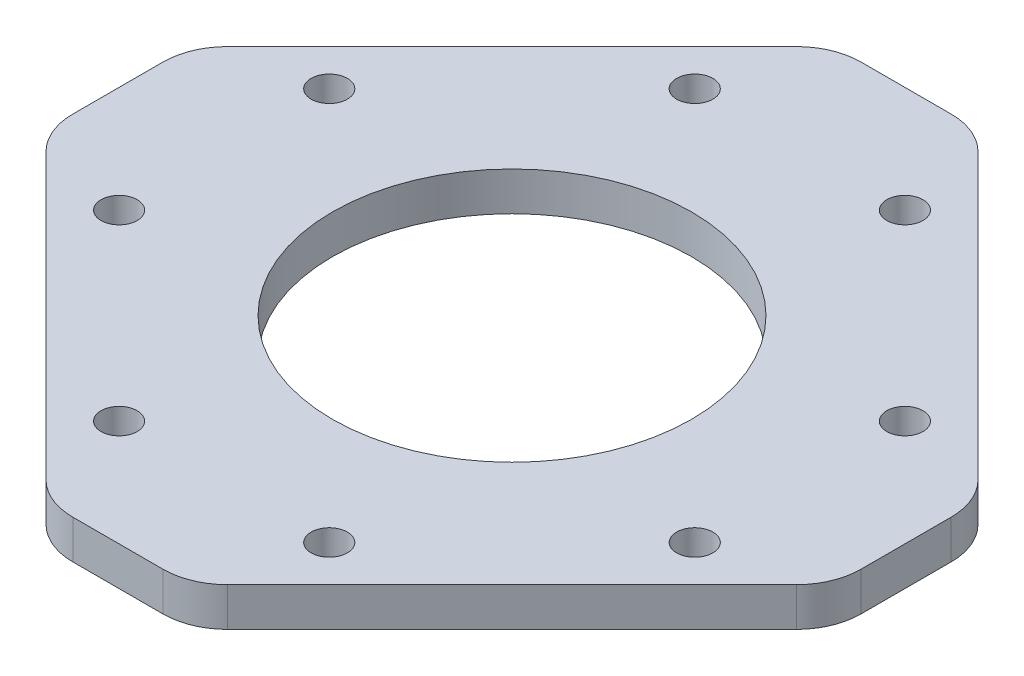
ISO-10303-21;
HEADER;
FILE_DESCRIPTION(('STEP AP214'),'2;1');
FILE_NAME('part.step','',(''),(''),'','','');
FILE_SCHEMA(('AUTOMOTIVE_DESIGN { 1 0 10303 214 1 1 1 1 }'));
ENDSEC;
DATA;
#1=APPLICATION_CONTEXT('core data for automotive mechanical design processes');
#2=APPLICATION_PROTOCOL_DEFINITION('international standard','automotive_design',2000,#1);
#3=PRODUCT_CONTEXT('',#1,'mechanical');
#4=PRODUCT('Part','Part','',(#3));
#5=PRODUCT_RELATED_PRODUCT_CATEGORY('part','',(#4));
#6=PRODUCT_DEFINITION_FORMATION('','',#4);
#7=PRODUCT_DEFINITION_CONTEXT('part definition',#1,'design');
#8=PRODUCT_DEFINITION('design','',#6,#7);
#9=PRODUCT_DEFINITION_SHAPE('','',#8);
#10=(LENGTH_UNIT() NAMED_UNIT(*) SI_UNIT(.MILLI.,.METRE.));
#11=(NAMED_UNIT(*) PLANE_ANGLE_UNIT() SI_UNIT($,.RADIAN.));
#12=(NAMED_UNIT(*) SI_UNIT($,.STERADIAN.) SOLID_ANGLE_UNIT());
#13=UNCERTAINTY_MEASURE_WITH_UNIT(LENGTH_MEASURE(1.E-05),#10,'distance_accuracy_value','');
#14=(GEOMETRIC_REPRESENTATION_CONTEXT(3) GLOBAL_UNCERTAINTY_ASSIGNED_CONTEXT((#13)) GLOBAL_UNIT_ASSIGNED_CONTEXT((#10,
#11,#12)) REPRESENTATION_CONTEXT('',''));
#15=CARTESIAN_POINT('',(0.,0.,0.));
#16=DIRECTION('',(0.,0.,1.));
#17=DIRECTION('',(1.,0.,0.));
#18=AXIS2_PLACEMENT_3D('',#15,#16,#17);
#19=CARTESIAN_POINT('',(3.49137802864851,3.,-25.5));
#20=DIRECTION('',(0.,1.,0.));
#21=DIRECTION('',(0.,0.,1.));
#22=AXIS2_PLACEMENT_3D('',#19,#20,#21);
#23=PLANE('',#22);
#24=CARTESIAN_POINT('',(-8.1317279836453,3.,-22.2738636073762));
#25=DIRECTION('',(0.,1.,0.));
#26=DIRECTION('',(0.,0.,1.));
#27=AXIS2_PLACEMENT_3D('',#24,#25,#26);
#28=CIRCLE('',#27,1.4);
#29=CARTESIAN_POINT('',(-8.1317279836453,3.,-20.8738636073762));
#30=VERTEX_POINT('',#29);
#31=EDGE_CURVE('E296',#30,#30,#28,.T.);
#32=ORIENTED_EDGE('',*,*,#31,.F.);
#33=EDGE_LOOP('',(#32));
#34=FACE_BOUND('',#33,.T.);
#35=CARTESIAN_POINT('',(22.2738636073762,3.,-8.1317279836453));
#36=DIRECTION('',(0.,1.,0.));
#37=DIRECTION('',(0.,0.,1.));
#38=AXIS2_PLACEMENT_3D('',#35,#36,#37);
#39=CIRCLE('',#38,1.4);
#40=CARTESIAN_POINT('',(22.2738636073762,3.,-6.7317279836453));
#41=VERTEX_POINT('',#40);
#42=EDGE_CURVE('E290',#41,#41,#39,.T.);
#43=ORIENTED_EDGE('',*,*,#42,.F.);
#44=EDGE_LOOP('',(#43));
#45=FACE_BOUND('',#44,.T.);
#46=CARTESIAN_POINT('',(-22.2738636073762,3.,8.1317279836453));
#47=DIRECTION('',(0.,1.,0.));
#48=DIRECTION('',(0.,0.,1.));
#49=AXIS2_PLACEMENT_3D('',#46,#47,#48);
#50=CIRCLE('',#49,1.4);
#51=CARTESIAN_POINT('',(-22.2738636073762,3.,9.5317279836453));
#52=VERTEX_POINT('',#51);
#53=EDGE_CURVE('E284',#52,#52,#50,.T.);
#54=ORIENTED_EDGE('',*,*,#53,.F.);
#55=EDGE_LOOP('',(#54));
#56=FACE_BOUND('',#55,.T.);
#57=CARTESIAN_POINT('',(8.13172798364529,3.,22.2738636073762));
#58=DIRECTION('',(0.,1.,0.));
#59=DIRECTION('',(0.,0.,1.));
#60=AXIS2_PLACEMENT_3D('',#57,#58,#59);
#61=CIRCLE('',#60,1.4);
#62=CARTESIAN_POINT('',(8.13172798364529,3.,23.6738636073762));
#63=VERTEX_POINT('',#62);
#64=EDGE_CURVE('E218',#63,#63,#61,.T.);
#65=ORIENTED_EDGE('',*,*,#64,.F.);
#66=EDGE_LOOP('',(#65));
#67=FACE_BOUND('',#66,.T.);
#68=CARTESIAN_POINT('',(3.49137802864851,3.,-25.5));
#69=DIRECTION('',(0.,1.,0.));
#70=DIRECTION('',(0.,0.,1.));
#71=AXIS2_PLACEMENT_3D('',#68,#69,#70);
#72=CIRCLE('',#71,4.99999999999999);
#73=CARTESIAN_POINT('',(7.02691193458125,3.,-29.0355339059327));
#74=VERTEX_POINT('',#73);
#75=CARTESIAN_POINT('',(3.49137802864851,3.,-30.5));
#76=VERTEX_POINT('',#75);
#77=EDGE_CURVE('E219',#74,#76,#72,.T.);
#78=ORIENTED_EDGE('',*,*,#77,.T.);
#79=DIRECTION('',(-1.,0.,0.));
#80=VECTOR('',#79,1.);
#81=CARTESIAN_POINT('',(3.49137802864851,3.,-30.5));
#82=LINE('',#81,#80);
#83=CARTESIAN_POINT('',(-3.4913780286485,3.,-30.5));
#84=VERTEX_POINT('',#83);
#85=EDGE_CURVE('E130',#76,#84,#82,.T.);
#86=ORIENTED_EDGE('',*,*,#85,.T.);
#87=CARTESIAN_POINT('',(-3.4913780286485,3.,-25.5));
#88=DIRECTION('',(0.,1.,0.));
#89=DIRECTION('',(0.,0.,1.));
#90=AXIS2_PLACEMENT_3D('',#87,#88,#89);
#91=CIRCLE('',#90,4.99999999999999);
#92=CARTESIAN_POINT('',(-7.02691193458124,3.,-29.0355339059327));
#93=VERTEX_POINT('',#92);
#94=EDGE_CURVE('E233',#84,#93,#91,.T.);
#95=ORIENTED_EDGE('',*,*,#94,.T.);
#96=DIRECTION('',(-0.707106781186547,0.,0.707106781186548));
#97=VECTOR('',#96,1.);
#98=CARTESIAN_POINT('',(-7.02691193458124,3.,-29.0355339059327));
#99=LINE('',#98,#97);
#100=CARTESIAN_POINT('',(-29.0355339059327,3.,-7.02691193458124));
#101=VERTEX_POINT('',#100);
#102=EDGE_CURVE('E236',#93,#101,#99,.T.);
#103=ORIENTED_EDGE('',*,*,#102,.T.);
#104=CARTESIAN_POINT('',(-25.5,3.,-3.4913780286485));
#105=DIRECTION('',(0.,1.,0.));
#106=DIRECTION('',(0.,0.,1.));
#107=AXIS2_PLACEMENT_3D('',#104,#105,#106);
#108=CIRCLE('',#107,4.99999999999999);
#109=CARTESIAN_POINT('',(-30.5,3.,-3.4913780286485));
#110=VERTEX_POINT('',#109);
#111=EDGE_CURVE('E240',#101,#110,#108,.T.);
#112=ORIENTED_EDGE('',*,*,#111,.T.);
#113=DIRECTION('',(0.,0.,1.));
#114=VECTOR('',#113,1.);
#115=CARTESIAN_POINT('',(-30.5,3.,-3.4913780286485));
#116=LINE('',#115,#114);
#117=CARTESIAN_POINT('',(-30.5,3.,3.4913780286485));
#118=VERTEX_POINT('',#117);
#119=EDGE_CURVE('E244',#110,#118,#116,.T.);
#120=ORIENTED_EDGE('',*,*,#119,.T.);
#121=CARTESIAN_POINT('',(-25.5,3.,3.4913780286485));
#122=DIRECTION('',(0.,1.,0.));
#123=DIRECTION('',(0.,0.,1.));
#124=AXIS2_PLACEMENT_3D('',#121,#122,#123);
#125=CIRCLE('',#124,4.99999999999999);
#126=CARTESIAN_POINT('',(-29.0355339059327,3.,7.02691193458123));
#127=VERTEX_POINT('',#126);
#128=EDGE_CURVE('E252',#118,#127,#125,.T.);
#129=ORIENTED_EDGE('',*,*,#128,.T.);
#130=DIRECTION('',(0.707106781186547,0.,0.707106781186548));
#131=VECTOR('',#130,1.);
#132=CARTESIAN_POINT('',(-29.0355339059327,3.,7.02691193458123));
#133=LINE('',#132,#131);
#134=CARTESIAN_POINT('',(-7.02691193458126,3.,29.0355339059327));
#135=VERTEX_POINT('',#134);
#136=EDGE_CURVE('E255',#127,#135,#133,.T.);
#137=ORIENTED_EDGE('',*,*,#136,.T.);
#138=CARTESIAN_POINT('',(-3.49137802864851,3.,25.5));
#139=DIRECTION('',(0.,1.,0.));
#140=DIRECTION('',(0.,0.,1.));
#141=AXIS2_PLACEMENT_3D('',#138,#139,#140);
#142=CIRCLE('',#141,4.99999999999999);
#143=CARTESIAN_POINT('',(-3.49137802864849,3.,30.5));
#144=VERTEX_POINT('',#143);
#145=EDGE_CURVE('E259',#135,#144,#142,.T.);
#146=ORIENTED_EDGE('',*,*,#145,.T.);
#147=DIRECTION('',(1.,0.,0.));
#148=VECTOR('',#147,1.);
#149=CARTESIAN_POINT('',(-3.49137802864849,3.,30.5));
#150=LINE('',#149,#148);
#151=CARTESIAN_POINT('',(3.49137802864853,3.,30.5));
#152=VERTEX_POINT('',#151);
#153=EDGE_CURVE('E263',#144,#152,#150,.T.);
#154=ORIENTED_EDGE('',*,*,#153,.T.);
#155=CARTESIAN_POINT('',(3.49137802864851,3.,25.5));
#156=DIRECTION('',(0.,1.,0.));
#157=DIRECTION('',(0.,0.,1.));
#158=AXIS2_PLACEMENT_3D('',#155,#156,#157);
#159=CIRCLE('',#158,4.99999999999999);
#160=CARTESIAN_POINT('',(7.02691193458125,3.,29.0355339059327));
#161=VERTEX_POINT('',#160);
#162=EDGE_CURVE('E270',#152,#161,#159,.T.);
#163=ORIENTED_EDGE('',*,*,#162,.T.);
#164=DIRECTION('',(0.707106781186547,0.,-0.707106781186548));
#165=VECTOR('',#164,1.);
#166=CARTESIAN_POINT('',(7.02691193458125,3.,29.0355339059327));
#167=LINE('',#166,#165);
#168=CARTESIAN_POINT('',(29.0355339059327,3.,7.02691193458124));
#169=VERTEX_POINT('',#168);
#170=EDGE_CURVE('E273',#161,#169,#167,.T.);
#171=ORIENTED_EDGE('',*,*,#170,.T.);
#172=CARTESIAN_POINT('',(25.5,3.,3.4913780286485));
#173=DIRECTION('',(0.,1.,0.));
#174=DIRECTION('',(0.,0.,1.));
#175=AXIS2_PLACEMENT_3D('',#172,#173,#174);
#176=CIRCLE('',#175,4.99999999999999);
#177=CARTESIAN_POINT('',(30.5,3.,3.4913780286485));
#178=VERTEX_POINT('',#177);
#179=EDGE_CURVE('E173',#169,#178,#176,.T.);
#180=ORIENTED_EDGE('',*,*,#179,.T.);
#181=DIRECTION('',(0.,0.,-1.));
#182=VECTOR('',#181,1.);
#183=CARTESIAN_POINT('',(30.5,3.,3.4913780286485));
#184=LINE('',#183,#182);
#185=CARTESIAN_POINT('',(30.5,3.,-3.49137802864851));
#186=VERTEX_POINT('',#185);
#187=EDGE_CURVE('E167',#178,#186,#184,.T.);
#188=ORIENTED_EDGE('',*,*,#187,.T.);
#189=CARTESIAN_POINT('',(25.5,3.,-3.49137802864851));
#190=DIRECTION('',(0.,1.,0.));
#191=DIRECTION('',(0.,0.,1.));
#192=AXIS2_PLACEMENT_3D('',#189,#190,#191);
#193=CIRCLE('',#192,4.99999999999999);
#194=CARTESIAN_POINT('',(29.0355339059327,3.,-7.02691193458125));
#195=VERTEX_POINT('',#194);
#196=EDGE_CURVE('E171',#186,#195,#193,.T.);
#197=ORIENTED_EDGE('',*,*,#196,.T.);
#198=DIRECTION('',(-0.707106781186547,0.,-0.707106781186547));
#199=VECTOR('',#198,1.);
#200=CARTESIAN_POINT('',(29.0355339059327,3.,-7.02691193458125));
#201=LINE('',#200,#199);
#202=EDGE_CURVE('E63',#195,#74,#201,.T.);
#203=ORIENTED_EDGE('',*,*,#202,.T.);
#204=EDGE_LOOP('',(#78,#86,#95,#103,#112,#120,#129,#137,#146,#154,#163,#171,#180,#188,#197,#203));
#205=FACE_BOUND('',#204,.T.);
#206=CARTESIAN_POINT('',(0.,3.,0.));
#207=DIRECTION('',(0.,1.,0.));
#208=DIRECTION('',(0.,0.,1.));
#209=AXIS2_PLACEMENT_3D('',#206,#207,#208);
#210=CIRCLE('',#209,13.9);
#211=CARTESIAN_POINT('',(0.,3.,13.9));
#212=VERTEX_POINT('',#211);
#213=EDGE_CURVE('E206',#212,#212,#210,.T.);
#214=ORIENTED_EDGE('',*,*,#213,.F.);
#215=EDGE_LOOP('',(#214));
#216=FACE_BOUND('',#215,.T.);
#217=CARTESIAN_POINT('',(-8.1317279836453,3.,22.2738636073763));
#218=DIRECTION('',(0.,1.,0.));
#219=DIRECTION('',(0.,0.,1.));
#220=AXIS2_PLACEMENT_3D('',#217,#218,#219);
#221=CIRCLE('',#220,1.4);
#222=CARTESIAN_POINT('',(-8.1317279836453,3.,23.6738636073763));
#223=VERTEX_POINT('',#222);
#224=EDGE_CURVE('E562',#223,#223,#221,.T.);
#225=ORIENTED_EDGE('',*,*,#224,.F.);
#226=EDGE_LOOP('',(#225));
#227=FACE_BOUND('',#226,.T.);
#228=CARTESIAN_POINT('',(22.2738636073762,3.,8.1317279836453));
#229=DIRECTION('',(0.,1.,0.));
#230=DIRECTION('',(0.,0.,1.));
#231=AXIS2_PLACEMENT_3D('',#228,#229,#230);
#232=CIRCLE('',#231,1.4);
#233=CARTESIAN_POINT('',(22.2738636073762,3.,9.5317279836453));
#234=VERTEX_POINT('',#233);
#235=EDGE_CURVE('E319',#234,#234,#232,.T.);
#236=ORIENTED_EDGE('',*,*,#235,.F.);
#237=EDGE_LOOP('',(#236));
#238=FACE_BOUND('',#237,.T.);
#239=CARTESIAN_POINT('',(8.1317279836453,3.,-22.2738636073762));
#240=DIRECTION('',(0.,1.,0.));
#241=DIRECTION('',(0.,0.,1.));
#242=AXIS2_PLACEMENT_3D('',#239,#240,#241);
#243=CIRCLE('',#242,1.4);
#244=CARTESIAN_POINT('',(8.1317279836453,3.,-20.8738636073762));
#245=VERTEX_POINT('',#244);
#246=EDGE_CURVE('E304',#245,#245,#243,.T.);
#247=ORIENTED_EDGE('',*,*,#246,.F.);
#248=EDGE_LOOP('',(#247));
#249=FACE_BOUND('',#248,.T.);
#250=CARTESIAN_POINT('',(-22.2738636073763,3.,-8.13172798364529));
#251=DIRECTION('',(0.,1.,0.));
#252=DIRECTION('',(0.,0.,1.));
#253=AXIS2_PLACEMENT_3D('',#250,#251,#252);
#254=CIRCLE('',#253,1.4);
#255=CARTESIAN_POINT('',(-22.2738636073763,3.,-6.73172798364529));
#256=VERTEX_POINT('',#255);
#257=EDGE_CURVE('E307',#256,#256,#254,.T.);
#258=ORIENTED_EDGE('',*,*,#257,.F.);
#259=EDGE_LOOP('',(#258));
#260=FACE_BOUND('',#259,.T.);
#261=ADVANCED_FACE('F46',(#34,#45,#56,#67,#205,#216,#227,#238,#249,#260),#23,.T.);
#262=CARTESIAN_POINT('',(3.49137802864851,0.,-25.5));
#263=DIRECTION('',(0.,1.,0.));
#264=DIRECTION('',(0.,0.,1.));
#265=AXIS2_PLACEMENT_3D('',#262,#263,#264);
#266=PLANE('',#265);
#267=CARTESIAN_POINT('',(3.49137802864851,0.,-25.5));
#268=DIRECTION('',(0.,1.,0.));
#269=DIRECTION('',(0.,0.,1.));
#270=AXIS2_PLACEMENT_3D('',#267,#268,#269);
#271=CIRCLE('',#270,4.99999999999999);
#272=CARTESIAN_POINT('',(7.02691193458125,0.,-29.0355339059327));
#273=VERTEX_POINT('',#272);
#274=CARTESIAN_POINT('',(3.49137802864851,0.,-30.5));
#275=VERTEX_POINT('',#274);
#276=EDGE_CURVE('E212',#273,#275,#271,.T.);
#277=ORIENTED_EDGE('',*,*,#276,.F.);
#278=DIRECTION('',(-0.707106781186547,0.,-0.707106781186547));
#279=VECTOR('',#278,1.);
#280=CARTESIAN_POINT('',(29.0355339059327,0.,-7.02691193458125));
#281=LINE('',#280,#279);
#282=CARTESIAN_POINT('',(29.0355339059327,0.,-7.02691193458125));
#283=VERTEX_POINT('',#282);
#284=EDGE_CURVE('E122',#283,#273,#281,.T.);
#285=ORIENTED_EDGE('',*,*,#284,.F.);
#286=CARTESIAN_POINT('',(25.5,0.,-3.49137802864851));
#287=DIRECTION('',(0.,1.,0.));
#288=DIRECTION('',(0.,0.,1.));
#289=AXIS2_PLACEMENT_3D('',#286,#287,#288);
#290=CIRCLE('',#289,4.99999999999999);
#291=CARTESIAN_POINT('',(30.5,0.,-3.49137802864851));
#292=VERTEX_POINT('',#291);
#293=EDGE_CURVE('E116',#292,#283,#290,.T.);
#294=ORIENTED_EDGE('',*,*,#293,.F.);
#295=DIRECTION('',(0.,0.,-1.));
#296=VECTOR('',#295,1.);
#297=CARTESIAN_POINT('',(30.5,0.,3.4913780286485));
#298=LINE('',#297,#296);
#299=CARTESIAN_POINT('',(30.5,0.,3.4913780286485));
#300=VERTEX_POINT('',#299);
#301=EDGE_CURVE('E182',#300,#292,#298,.T.);
#302=ORIENTED_EDGE('',*,*,#301,.F.);
#303=CARTESIAN_POINT('',(25.5,0.,3.4913780286485));
#304=DIRECTION('',(0.,1.,0.));
#305=DIRECTION('',(0.,0.,1.));
#306=AXIS2_PLACEMENT_3D('',#303,#304,#305);
#307=CIRCLE('',#306,4.99999999999999);
#308=CARTESIAN_POINT('',(29.0355339059327,0.,7.02691193458124));
#309=VERTEX_POINT('',#308);
#310=EDGE_CURVE('E475',#309,#300,#307,.T.);
#311=ORIENTED_EDGE('',*,*,#310,.F.);
#312=DIRECTION('',(0.707106781186547,0.,-0.707106781186548));
#313=VECTOR('',#312,1.);
#314=CARTESIAN_POINT('',(7.02691193458125,0.,29.0355339059327));
#315=LINE('',#314,#313);
#316=CARTESIAN_POINT('',(7.02691193458125,0.,29.0355339059327));
#317=VERTEX_POINT('',#316);
#318=EDGE_CURVE('E473',#317,#309,#315,.T.);
#319=ORIENTED_EDGE('',*,*,#318,.F.);
#320=CARTESIAN_POINT('',(3.49137802864851,0.,25.5));
#321=DIRECTION('',(0.,1.,0.));
#322=DIRECTION('',(0.,0.,1.));
#323=AXIS2_PLACEMENT_3D('',#320,#321,#322);
#324=CIRCLE('',#323,4.99999999999999);
#325=CARTESIAN_POINT('',(3.49137802864853,0.,30.5));
#326=VERTEX_POINT('',#325);
#327=EDGE_CURVE('E471',#326,#317,#324,.T.);
#328=ORIENTED_EDGE('',*,*,#327,.F.);
#329=DIRECTION('',(1.,0.,0.));
#330=VECTOR('',#329,1.);
#331=CARTESIAN_POINT('',(-3.49137802864849,0.,30.5));
#332=LINE('',#331,#330);
#333=CARTESIAN_POINT('',(-3.49137802864849,0.,30.5));
#334=VERTEX_POINT('',#333);
#335=EDGE_CURVE('E469',#334,#326,#332,.T.);
#336=ORIENTED_EDGE('',*,*,#335,.F.);
#337=CARTESIAN_POINT('',(-3.49137802864851,0.,25.5));
#338=DIRECTION('',(0.,1.,0.));
#339=DIRECTION('',(0.,0.,1.));
#340=AXIS2_PLACEMENT_3D('',#337,#338,#339);
#341=CIRCLE('',#340,4.99999999999999);
#342=CARTESIAN_POINT('',(-7.02691193458126,0.,29.0355339059327));
#343=VERTEX_POINT('',#342);
#344=EDGE_CURVE('E467',#343,#334,#341,.T.);
#345=ORIENTED_EDGE('',*,*,#344,.F.);
#346=DIRECTION('',(0.707106781186547,0.,0.707106781186548));
#347=VECTOR('',#346,1.);
#348=CARTESIAN_POINT('',(-29.0355339059327,0.,7.02691193458123));
#349=LINE('',#348,#347);
#350=CARTESIAN_POINT('',(-29.0355339059327,0.,7.02691193458123));
#351=VERTEX_POINT('',#350);
#352=EDGE_CURVE('E465',#351,#343,#349,.T.);
#353=ORIENTED_EDGE('',*,*,#352,.F.);
#354=CARTESIAN_POINT('',(-25.5,0.,3.4913780286485));
#355=DIRECTION('',(0.,1.,0.));
#356=DIRECTION('',(0.,0.,1.));
#357=AXIS2_PLACEMENT_3D('',#354,#355,#356);
#358=CIRCLE('',#357,4.99999999999999);
#359=CARTESIAN_POINT('',(-30.5,0.,3.4913780286485));
#360=VERTEX_POINT('',#359);
#361=EDGE_CURVE('E463',#360,#351,#358,.T.);
#362=ORIENTED_EDGE('',*,*,#361,.F.);
#363=DIRECTION('',(0.,0.,1.));
#364=VECTOR('',#363,1.);
#365=CARTESIAN_POINT('',(-30.5,0.,-3.4913780286485));
#366=LINE('',#365,#364);
#367=CARTESIAN_POINT('',(-30.5,0.,-3.4913780286485));
#368=VERTEX_POINT('',#367);
#369=EDGE_CURVE('E461',#368,#360,#366,.T.);
#370=ORIENTED_EDGE('',*,*,#369,.F.);
#371=CARTESIAN_POINT('',(-25.5,0.,-3.4913780286485));
#372=DIRECTION('',(0.,1.,0.));
#373=DIRECTION('',(0.,0.,1.));
#374=AXIS2_PLACEMENT_3D('',#371,#372,#373);
#375=CIRCLE('',#374,4.99999999999999);
#376=CARTESIAN_POINT('',(-29.0355339059327,0.,-7.02691193458124));
#377=VERTEX_POINT('',#376);
#378=EDGE_CURVE('E457',#377,#368,#375,.T.);
#379=ORIENTED_EDGE('',*,*,#378,.F.);
#380=DIRECTION('',(-0.707106781186547,0.,0.707106781186548));
#381=VECTOR('',#380,1.);
#382=CARTESIAN_POINT('',(-7.02691193458124,0.,-29.0355339059327));
#383=LINE('',#382,#381);
#384=CARTESIAN_POINT('',(-7.02691193458124,0.,-29.0355339059327));
#385=VERTEX_POINT('',#384);
#386=EDGE_CURVE('E455',#385,#377,#383,.T.);
#387=ORIENTED_EDGE('',*,*,#386,.F.);
#388=CARTESIAN_POINT('',(-3.4913780286485,0.,-25.5));
#389=DIRECTION('',(0.,1.,0.));
#390=DIRECTION('',(0.,0.,1.));
#391=AXIS2_PLACEMENT_3D('',#388,#389,#390);
#392=CIRCLE('',#391,4.99999999999999);
#393=CARTESIAN_POINT('',(-3.4913780286485,0.,-30.5));
#394=VERTEX_POINT('',#393);
#395=EDGE_CURVE('E447',#394,#385,#392,.T.);
#396=ORIENTED_EDGE('',*,*,#395,.F.);
#397=DIRECTION('',(-1.,0.,0.));
#398=VECTOR('',#397,1.);
#399=CARTESIAN_POINT('',(3.49137802864851,0.,-30.5));
#400=LINE('',#399,#398);
#401=EDGE_CURVE('E440',#275,#394,#400,.T.);
#402=ORIENTED_EDGE('',*,*,#401,.F.);
#403=EDGE_LOOP('',(#277,#285,#294,#302,#311,#319,#328,#336,#345,#353,#362,#370,#379,#387,#396,#402));
#404=FACE_BOUND('',#403,.T.);
#405=CARTESIAN_POINT('',(0.,0.,0.));
#406=DIRECTION('',(0.,1.,0.));
#407=DIRECTION('',(0.,0.,1.));
#408=AXIS2_PLACEMENT_3D('',#405,#406,#407);
#409=CIRCLE('',#408,13.9);
#410=CARTESIAN_POINT('',(0.,0.,13.9));
#411=VERTEX_POINT('',#410);
#412=EDGE_CURVE('E213',#411,#411,#409,.T.);
#413=ORIENTED_EDGE('',*,*,#412,.T.);
#414=EDGE_LOOP('',(#413));
#415=FACE_BOUND('',#414,.T.);
#416=CARTESIAN_POINT('',(8.13172798364529,0.,22.2738636073762));
#417=DIRECTION('',(0.,1.,0.));
#418=DIRECTION('',(0.,0.,1.));
#419=AXIS2_PLACEMENT_3D('',#416,#417,#418);
#420=CIRCLE('',#419,1.4);
#421=CARTESIAN_POINT('',(8.13172798364529,0.,23.6738636073762));
#422=VERTEX_POINT('',#421);
#423=EDGE_CURVE('E214',#422,#422,#420,.T.);
#424=ORIENTED_EDGE('',*,*,#423,.T.);
#425=EDGE_LOOP('',(#424));
#426=FACE_BOUND('',#425,.T.);
#427=CARTESIAN_POINT('',(-8.1317279836453,0.,22.2738636073763));
#428=DIRECTION('',(0.,1.,0.));
#429=DIRECTION('',(0.,0.,1.));
#430=AXIS2_PLACEMENT_3D('',#427,#428,#429);
#431=CIRCLE('',#430,1.4);
#432=CARTESIAN_POINT('',(-8.1317279836453,0.,23.6738636073763));
#433=VERTEX_POINT('',#432);
#434=EDGE_CURVE('E287',#433,#433,#431,.T.);
#435=ORIENTED_EDGE('',*,*,#434,.T.);
#436=EDGE_LOOP('',(#435));
#437=FACE_BOUND('',#436,.T.);
#438=CARTESIAN_POINT('',(-22.2738636073762,0.,8.1317279836453));
#439=DIRECTION('',(0.,1.,0.));
#440=DIRECTION('',(0.,0.,1.));
#441=AXIS2_PLACEMENT_3D('',#438,#439,#440);
#442=CIRCLE('',#441,1.4);
#443=CARTESIAN_POINT('',(-22.2738636073762,0.,9.5317279836453));
#444=VERTEX_POINT('',#443);
#445=EDGE_CURVE('E288',#444,#444,#442,.T.);
#446=ORIENTED_EDGE('',*,*,#445,.T.);
#447=EDGE_LOOP('',(#446));
#448=FACE_BOUND('',#447,.T.);
#449=CARTESIAN_POINT('',(22.2738636073762,0.,8.1317279836453));
#450=DIRECTION('',(0.,1.,0.));
#451=DIRECTION('',(0.,0.,1.));
#452=AXIS2_PLACEMENT_3D('',#449,#450,#451);
#453=CIRCLE('',#452,1.4);
#454=CARTESIAN_POINT('',(22.2738636073762,0.,9.5317279836453));
#455=VERTEX_POINT('',#454);
#456=EDGE_CURVE('E293',#455,#455,#453,.T.);
#457=ORIENTED_EDGE('',*,*,#456,.T.);
#458=EDGE_LOOP('',(#457));
#459=FACE_BOUND('',#458,.T.);
#460=CARTESIAN_POINT('',(22.2738636073762,0.,-8.1317279836453));
#461=DIRECTION('',(0.,1.,0.));
#462=DIRECTION('',(0.,0.,1.));
#463=AXIS2_PLACEMENT_3D('',#460,#461,#462);
#464=CIRCLE('',#463,1.4);
#465=CARTESIAN_POINT('',(22.2738636073762,0.,-6.7317279836453));
#466=VERTEX_POINT('',#465);
#467=EDGE_CURVE('E294',#466,#466,#464,.T.);
#468=ORIENTED_EDGE('',*,*,#467,.T.);
#469=EDGE_LOOP('',(#468));
#470=FACE_BOUND('',#469,.T.);
#471=CARTESIAN_POINT('',(8.1317279836453,0.,-22.2738636073762));
#472=DIRECTION('',(0.,1.,0.));
#473=DIRECTION('',(0.,0.,1.));
#474=AXIS2_PLACEMENT_3D('',#471,#472,#473);
#475=CIRCLE('',#474,1.4);
#476=CARTESIAN_POINT('',(8.1317279836453,0.,-20.8738636073762));
#477=VERTEX_POINT('',#476);
#478=EDGE_CURVE('E298',#477,#477,#475,.T.);
#479=ORIENTED_EDGE('',*,*,#478,.T.);
#480=EDGE_LOOP('',(#479));
#481=FACE_BOUND('',#480,.T.);
#482=CARTESIAN_POINT('',(-8.1317279836453,0.,-22.2738636073762));
#483=DIRECTION('',(0.,1.,0.));
#484=DIRECTION('',(0.,0.,1.));
#485=AXIS2_PLACEMENT_3D('',#482,#483,#484);
#486=CIRCLE('',#485,1.4);
#487=CARTESIAN_POINT('',(-8.1317279836453,0.,-20.8738636073762));
#488=VERTEX_POINT('',#487);
#489=EDGE_CURVE('E299',#488,#488,#486,.T.);
#490=ORIENTED_EDGE('',*,*,#489,.T.);
#491=EDGE_LOOP('',(#490));
#492=FACE_BOUND('',#491,.T.);
#493=CARTESIAN_POINT('',(-22.2738636073763,0.,-8.13172798364529));
#494=DIRECTION('',(0.,1.,0.));
#495=DIRECTION('',(0.,0.,1.));
#496=AXIS2_PLACEMENT_3D('',#493,#494,#495);
#497=CIRCLE('',#496,1.4);
#498=CARTESIAN_POINT('',(-22.2738636073763,0.,-6.73172798364529));
#499=VERTEX_POINT('',#498);
#500=EDGE_CURVE('E311',#499,#499,#497,.T.);
#501=ORIENTED_EDGE('',*,*,#500,.T.);
#502=EDGE_LOOP('',(#501));
#503=FACE_BOUND('',#502,.T.);
#504=ADVANCED_FACE('F335',(#404,#415,#426,#437,#448,#459,#470,#481,#492,#503),#266,.F.);
#505=CARTESIAN_POINT('',(3.49137802864851,3.,-25.5));
#506=DIRECTION('',(0.,-1.,0.));
#507=DIRECTION('',(0.,0.,-1.));
#508=AXIS2_PLACEMENT_3D('',#505,#506,#507);
#509=CYLINDRICAL_SURFACE('',#508,4.99999999999999);
#510=ORIENTED_EDGE('',*,*,#276,.T.);
#511=DIRECTION('',(0.,-1.,0.));
#512=VECTOR('',#511,1.);
#513=CARTESIAN_POINT('',(3.49137802864851,3.,-30.5));
#514=LINE('',#513,#512);
#515=EDGE_CURVE('E12',#76,#275,#514,.T.);
#516=ORIENTED_EDGE('',*,*,#515,.F.);
#517=ORIENTED_EDGE('',*,*,#77,.F.);
#518=DIRECTION('',(0.,-1.,0.));
#519=VECTOR('',#518,1.);
#520=CARTESIAN_POINT('',(7.02691193458125,3.,-29.0355339059327));
#521=LINE('',#520,#519);
#522=EDGE_CURVE('E190',#74,#273,#521,.T.);
#523=ORIENTED_EDGE('',*,*,#522,.T.);
#524=EDGE_LOOP('',(#510,#516,#517,#523));
#525=FACE_BOUND('',#524,.T.);
#526=ADVANCED_FACE('F48',(#525),#509,.T.);
#527=CARTESIAN_POINT('',(3.49137802864851,3.,-30.5));
#528=DIRECTION('',(0.,0.,1.));
#529=DIRECTION('',(1.,0.,0.));
#530=AXIS2_PLACEMENT_3D('',#527,#528,#529);
#531=PLANE('',#530);
#532=ORIENTED_EDGE('',*,*,#401,.T.);
#533=DIRECTION('',(0.,-1.,0.));
#534=VECTOR('',#533,1.);
#535=CARTESIAN_POINT('',(-3.4913780286485,3.,-30.5));
#536=LINE('',#535,#534);
#537=EDGE_CURVE('E55',#84,#394,#536,.T.);
#538=ORIENTED_EDGE('',*,*,#537,.F.);
#539=ORIENTED_EDGE('',*,*,#85,.F.);
#540=ORIENTED_EDGE('',*,*,#515,.T.);
#541=EDGE_LOOP('',(#532,#538,#539,#540));
#542=FACE_BOUND('',#541,.T.);
#543=ADVANCED_FACE('F433',(#542),#531,.F.);
#544=CARTESIAN_POINT('',(-3.4913780286485,3.,-25.5));
#545=DIRECTION('',(0.,-1.,0.));
#546=DIRECTION('',(0.,0.,-1.));
#547=AXIS2_PLACEMENT_3D('',#544,#545,#546);
#548=CYLINDRICAL_SURFACE('',#547,4.99999999999999);
#549=ORIENTED_EDGE('',*,*,#395,.T.);
#550=DIRECTION('',(0.,-1.,0.));
#551=VECTOR('',#550,1.);
#552=CARTESIAN_POINT('',(-7.02691193458124,3.,-29.0355339059327));
#553=LINE('',#552,#551);
#554=EDGE_CURVE('E451',#93,#385,#553,.T.);
#555=ORIENTED_EDGE('',*,*,#554,.F.);
#556=ORIENTED_EDGE('',*,*,#94,.F.);
#557=ORIENTED_EDGE('',*,*,#537,.T.);
#558=EDGE_LOOP('',(#549,#555,#556,#557));
#559=FACE_BOUND('',#558,.T.);
#560=ADVANCED_FACE('F430',(#559),#548,.T.);
#561=CARTESIAN_POINT('',(-7.02691193458124,3.,-29.0355339059327));
#562=DIRECTION('',(0.707106781186548,0.,0.707106781186547));
#563=DIRECTION('',(0.707106781186547,0.,-0.707106781186548));
#564=AXIS2_PLACEMENT_3D('',#561,#562,#563);
#565=PLANE('',#564);
#566=ORIENTED_EDGE('',*,*,#386,.T.);
#567=DIRECTION('',(0.,-1.,0.));
#568=VECTOR('',#567,1.);
#569=CARTESIAN_POINT('',(-29.0355339059327,3.,-7.02691193458124));
#570=LINE('',#569,#568);
#571=EDGE_CURVE('E507',#101,#377,#570,.T.);
#572=ORIENTED_EDGE('',*,*,#571,.F.);
#573=ORIENTED_EDGE('',*,*,#102,.F.);
#574=ORIENTED_EDGE('',*,*,#554,.T.);
#575=EDGE_LOOP('',(#566,#572,#573,#574));
#576=FACE_BOUND('',#575,.T.);
#577=ADVANCED_FACE('F426',(#576),#565,.F.);
#578=CARTESIAN_POINT('',(-25.5,3.,-3.4913780286485));
#579=DIRECTION('',(0.,-1.,0.));
#580=DIRECTION('',(0.,0.,-1.));
#581=AXIS2_PLACEMENT_3D('',#578,#579,#580);
#582=CYLINDRICAL_SURFACE('',#581,4.99999999999999);
#583=ORIENTED_EDGE('',*,*,#378,.T.);
#584=DIRECTION('',(0.,-1.,0.));
#585=VECTOR('',#584,1.);
#586=CARTESIAN_POINT('',(-30.5,3.,-3.4913780286485));
#587=LINE('',#586,#585);
#588=EDGE_CURVE('E504',#110,#368,#587,.T.);
#589=ORIENTED_EDGE('',*,*,#588,.F.);
#590=ORIENTED_EDGE('',*,*,#111,.F.);
#591=ORIENTED_EDGE('',*,*,#571,.T.);
#592=EDGE_LOOP('',(#583,#589,#590,#591));
#593=FACE_BOUND('',#592,.T.);
#594=ADVANCED_FACE('F422',(#593),#582,.T.);
#595=CARTESIAN_POINT('',(-30.5,3.,-3.4913780286485));
#596=DIRECTION('',(1.,0.,0.));
#597=DIRECTION('',(0.,0.,-1.));
#598=AXIS2_PLACEMENT_3D('',#595,#596,#597);
#599=PLANE('',#598);
#600=ORIENTED_EDGE('',*,*,#369,.T.);
#601=DIRECTION('',(0.,-1.,0.));
#602=VECTOR('',#601,1.);
#603=CARTESIAN_POINT('',(-30.5,3.,3.4913780286485));
#604=LINE('',#603,#602);
#605=EDGE_CURVE('E501',#118,#360,#604,.T.);
#606=ORIENTED_EDGE('',*,*,#605,.F.);
#607=ORIENTED_EDGE('',*,*,#119,.F.);
#608=ORIENTED_EDGE('',*,*,#588,.T.);
#609=EDGE_LOOP('',(#600,#606,#607,#608));
#610=FACE_BOUND('',#609,.T.);
#611=ADVANCED_FACE('F418',(#610),#599,.F.);
#612=CARTESIAN_POINT('',(-25.5,3.,3.4913780286485));
#613=DIRECTION('',(0.,-1.,0.));
#614=DIRECTION('',(0.,0.,-1.));
#615=AXIS2_PLACEMENT_3D('',#612,#613,#614);
#616=CYLINDRICAL_SURFACE('',#615,4.99999999999999);
#617=ORIENTED_EDGE('',*,*,#361,.T.);
#618=DIRECTION('',(0.,-1.,0.));
#619=VECTOR('',#618,1.);
#620=CARTESIAN_POINT('',(-29.0355339059327,3.,7.02691193458123));
#621=LINE('',#620,#619);
#622=EDGE_CURVE('E498',#127,#351,#621,.T.);
#623=ORIENTED_EDGE('',*,*,#622,.F.);
#624=ORIENTED_EDGE('',*,*,#128,.F.);
#625=ORIENTED_EDGE('',*,*,#605,.T.);
#626=EDGE_LOOP('',(#617,#623,#624,#625));
#627=FACE_BOUND('',#626,.T.);
#628=ADVANCED_FACE('F414',(#627),#616,.T.);
#629=CARTESIAN_POINT('',(-29.0355339059327,3.,7.02691193458123));
#630=DIRECTION('',(0.707106781186548,0.,-0.707106781186547));
#631=DIRECTION('',(-0.707106781186547,0.,-0.707106781186548));
#632=AXIS2_PLACEMENT_3D('',#629,#630,#631);
#633=PLANE('',#632);
#634=ORIENTED_EDGE('',*,*,#352,.T.);
#635=DIRECTION('',(0.,-1.,0.));
#636=VECTOR('',#635,1.);
#637=CARTESIAN_POINT('',(-7.02691193458126,3.,29.0355339059327));
#638=LINE('',#637,#636);
#639=EDGE_CURVE('E495',#135,#343,#638,.T.);
#640=ORIENTED_EDGE('',*,*,#639,.F.);
#641=ORIENTED_EDGE('',*,*,#136,.F.);
#642=ORIENTED_EDGE('',*,*,#622,.T.);
#643=EDGE_LOOP('',(#634,#640,#641,#642));
#644=FACE_BOUND('',#643,.T.);
#645=ADVANCED_FACE('F410',(#644),#633,.F.);
#646=CARTESIAN_POINT('',(-3.49137802864851,3.,25.5));
#647=DIRECTION('',(0.,-1.,0.));
#648=DIRECTION('',(0.,0.,-1.));
#649=AXIS2_PLACEMENT_3D('',#646,#647,#648);
#650=CYLINDRICAL_SURFACE('',#649,4.99999999999999);
#651=ORIENTED_EDGE('',*,*,#344,.T.);
#652=DIRECTION('',(0.,-1.,0.));
#653=VECTOR('',#652,1.);
#654=CARTESIAN_POINT('',(-3.49137802864849,3.,30.5));
#655=LINE('',#654,#653);
#656=EDGE_CURVE('E492',#144,#334,#655,.T.);
#657=ORIENTED_EDGE('',*,*,#656,.F.);
#658=ORIENTED_EDGE('',*,*,#145,.F.);
#659=ORIENTED_EDGE('',*,*,#639,.T.);
#660=EDGE_LOOP('',(#651,#657,#658,#659));
#661=FACE_BOUND('',#660,.T.);
#662=ADVANCED_FACE('F406',(#661),#650,.T.);
#663=CARTESIAN_POINT('',(-3.49137802864849,3.,30.5));
#664=DIRECTION('',(0.,0.,-1.));
#665=DIRECTION('',(-1.,0.,0.));
#666=AXIS2_PLACEMENT_3D('',#663,#664,#665);
#667=PLANE('',#666);
#668=ORIENTED_EDGE('',*,*,#335,.T.);
#669=DIRECTION('',(0.,-1.,0.));
#670=VECTOR('',#669,1.);
#671=CARTESIAN_POINT('',(3.49137802864853,3.,30.5));
#672=LINE('',#671,#670);
#673=EDGE_CURVE('E489',#152,#326,#672,.T.);
#674=ORIENTED_EDGE('',*,*,#673,.F.);
#675=ORIENTED_EDGE('',*,*,#153,.F.);
#676=ORIENTED_EDGE('',*,*,#656,.T.);
#677=EDGE_LOOP('',(#668,#674,#675,#676));
#678=FACE_BOUND('',#677,.T.);
#679=ADVANCED_FACE('F402',(#678),#667,.F.);
#680=CARTESIAN_POINT('',(3.49137802864851,3.,25.5));
#681=DIRECTION('',(0.,-1.,0.));
#682=DIRECTION('',(0.,0.,-1.));
#683=AXIS2_PLACEMENT_3D('',#680,#681,#682);
#684=CYLINDRICAL_SURFACE('',#683,4.99999999999999);
#685=ORIENTED_EDGE('',*,*,#327,.T.);
#686=DIRECTION('',(0.,-1.,0.));
#687=VECTOR('',#686,1.);
#688=CARTESIAN_POINT('',(7.02691193458125,3.,29.0355339059327));
#689=LINE('',#688,#687);
#690=EDGE_CURVE('E486',#161,#317,#689,.T.);
#691=ORIENTED_EDGE('',*,*,#690,.F.);
#692=ORIENTED_EDGE('',*,*,#162,.F.);
#693=ORIENTED_EDGE('',*,*,#673,.T.);
#694=EDGE_LOOP('',(#685,#691,#692,#693));
#695=FACE_BOUND('',#694,.T.);
#696=ADVANCED_FACE('F398',(#695),#684,.T.);
#697=CARTESIAN_POINT('',(7.02691193458125,3.,29.0355339059327));
#698=DIRECTION('',(-0.707106781186548,0.,-0.707106781186547));
#699=DIRECTION('',(-0.707106781186547,0.,0.707106781186548));
#700=AXIS2_PLACEMENT_3D('',#697,#698,#699);
#701=PLANE('',#700);
#702=ORIENTED_EDGE('',*,*,#318,.T.);
#703=DIRECTION('',(0.,-1.,0.));
#704=VECTOR('',#703,1.);
#705=CARTESIAN_POINT('',(29.0355339059327,3.,7.02691193458124));
#706=LINE('',#705,#704);
#707=EDGE_CURVE('E483',#169,#309,#706,.T.);
#708=ORIENTED_EDGE('',*,*,#707,.F.);
#709=ORIENTED_EDGE('',*,*,#170,.F.);
#710=ORIENTED_EDGE('',*,*,#690,.T.);
#711=EDGE_LOOP('',(#702,#708,#709,#710));
#712=FACE_BOUND('',#711,.T.);
#713=ADVANCED_FACE('F394',(#712),#701,.F.);
#714=CARTESIAN_POINT('',(25.5,3.,3.4913780286485));
#715=DIRECTION('',(0.,-1.,0.));
#716=DIRECTION('',(0.,0.,-1.));
#717=AXIS2_PLACEMENT_3D('',#714,#715,#716);
#718=CYLINDRICAL_SURFACE('',#717,4.99999999999999);
#719=ORIENTED_EDGE('',*,*,#310,.T.);
#720=DIRECTION('',(0.,-1.,0.));
#721=VECTOR('',#720,1.);
#722=CARTESIAN_POINT('',(30.5,3.,3.4913780286485));
#723=LINE('',#722,#721);
#724=EDGE_CURVE('E183',#178,#300,#723,.T.);
#725=ORIENTED_EDGE('',*,*,#724,.F.);
#726=ORIENTED_EDGE('',*,*,#179,.F.);
#727=ORIENTED_EDGE('',*,*,#707,.T.);
#728=EDGE_LOOP('',(#719,#725,#726,#727));
#729=FACE_BOUND('',#728,.T.);
#730=ADVANCED_FACE('F391',(#729),#718,.T.);
#731=CARTESIAN_POINT('',(30.5,3.,3.4913780286485));
#732=DIRECTION('',(-1.,0.,0.));
#733=DIRECTION('',(0.,0.,1.));
#734=AXIS2_PLACEMENT_3D('',#731,#732,#733);
#735=PLANE('',#734);
#736=ORIENTED_EDGE('',*,*,#301,.T.);
#737=DIRECTION('',(0.,-1.,0.));
#738=VECTOR('',#737,1.);
#739=CARTESIAN_POINT('',(30.5,3.,-3.49137802864851));
#740=LINE('',#739,#738);
#741=EDGE_CURVE('E179',#186,#292,#740,.T.);
#742=ORIENTED_EDGE('',*,*,#741,.F.);
#743=ORIENTED_EDGE('',*,*,#187,.F.);
#744=ORIENTED_EDGE('',*,*,#724,.T.);
#745=EDGE_LOOP('',(#736,#742,#743,#744));
#746=FACE_BOUND('',#745,.T.);
#747=ADVANCED_FACE('F180',(#746),#735,.F.);
#748=CARTESIAN_POINT('',(25.5,3.,-3.49137802864851));
#749=DIRECTION('',(0.,-1.,0.));
#750=DIRECTION('',(0.,0.,-1.));
#751=AXIS2_PLACEMENT_3D('',#748,#749,#750);
#752=CYLINDRICAL_SURFACE('',#751,4.99999999999999);
#753=ORIENTED_EDGE('',*,*,#293,.T.);
#754=DIRECTION('',(0.,-1.,0.));
#755=VECTOR('',#754,1.);
#756=CARTESIAN_POINT('',(29.0355339059327,3.,-7.02691193458125));
#757=LINE('',#756,#755);
#758=EDGE_CURVE('E184',#195,#283,#757,.T.);
#759=ORIENTED_EDGE('',*,*,#758,.F.);
#760=ORIENTED_EDGE('',*,*,#196,.F.);
#761=ORIENTED_EDGE('',*,*,#741,.T.);
#762=EDGE_LOOP('',(#753,#759,#760,#761));
#763=FACE_BOUND('',#762,.T.);
#764=ADVANCED_FACE('F186',(#763),#752,.T.);
#765=CARTESIAN_POINT('',(29.0355339059327,3.,-7.02691193458125));
#766=DIRECTION('',(-0.707106781186548,0.,0.707106781186548));
#767=DIRECTION('',(0.707106781186548,0.,0.707106781186548));
#768=AXIS2_PLACEMENT_3D('',#765,#766,#767);
#769=PLANE('',#768);
#770=ORIENTED_EDGE('',*,*,#284,.T.);
#771=ORIENTED_EDGE('',*,*,#522,.F.);
#772=ORIENTED_EDGE('',*,*,#202,.F.);
#773=ORIENTED_EDGE('',*,*,#758,.T.);
#774=EDGE_LOOP('',(#770,#771,#772,#773));
#775=FACE_BOUND('',#774,.T.);
#776=ADVANCED_FACE('F379',(#775),#769,.F.);
#777=CARTESIAN_POINT('',(0.,3.,0.));
#778=DIRECTION('',(0.,-1.,0.));
#779=DIRECTION('',(0.,0.,-1.));
#780=AXIS2_PLACEMENT_3D('',#777,#778,#779);
#781=CYLINDRICAL_SURFACE('',#780,13.9);
#782=ORIENTED_EDGE('',*,*,#213,.T.);
#783=EDGE_LOOP('',(#782));
#784=FACE_BOUND('',#783,.T.);
#785=ORIENTED_EDGE('',*,*,#412,.F.);
#786=EDGE_LOOP('',(#785));
#787=FACE_BOUND('',#786,.T.);
#788=ADVANCED_FACE('F376',(#784,#787),#781,.F.);
#789=CARTESIAN_POINT('',(8.13172798364529,3.,22.2738636073762));
#790=DIRECTION('',(0.,-1.,0.));
#791=DIRECTION('',(0.,0.,-1.));
#792=AXIS2_PLACEMENT_3D('',#789,#790,#791);
#793=CYLINDRICAL_SURFACE('',#792,1.4);
#794=ORIENTED_EDGE('',*,*,#64,.T.);
#795=EDGE_LOOP('',(#794));
#796=FACE_BOUND('',#795,.T.);
#797=ORIENTED_EDGE('',*,*,#423,.F.);
#798=EDGE_LOOP('',(#797));
#799=FACE_BOUND('',#798,.T.);
#800=ADVANCED_FACE('F372',(#796,#799),#793,.F.);
#801=CARTESIAN_POINT('',(-8.1317279836453,3.,22.2738636073763));
#802=DIRECTION('',(0.,-1.,0.));
#803=DIRECTION('',(0.,0.,-1.));
#804=AXIS2_PLACEMENT_3D('',#801,#802,#803);
#805=CYLINDRICAL_SURFACE('',#804,1.4);
#806=ORIENTED_EDGE('',*,*,#224,.T.);
#807=EDGE_LOOP('',(#806));
#808=FACE_BOUND('',#807,.T.);
#809=ORIENTED_EDGE('',*,*,#434,.F.);
#810=EDGE_LOOP('',(#809));
#811=FACE_BOUND('',#810,.T.);
#812=ADVANCED_FACE('F368',(#808,#811),#805,.F.);
#813=CARTESIAN_POINT('',(-22.2738636073762,3.,8.1317279836453));
#814=DIRECTION('',(0.,-1.,0.));
#815=DIRECTION('',(0.,0.,-1.));
#816=AXIS2_PLACEMENT_3D('',#813,#814,#815);
#817=CYLINDRICAL_SURFACE('',#816,1.4);
#818=ORIENTED_EDGE('',*,*,#53,.T.);
#819=EDGE_LOOP('',(#818));
#820=FACE_BOUND('',#819,.T.);
#821=ORIENTED_EDGE('',*,*,#445,.F.);
#822=EDGE_LOOP('',(#821));
#823=FACE_BOUND('',#822,.T.);
#824=ADVANCED_FACE('F364',(#820,#823),#817,.F.);
#825=CARTESIAN_POINT('',(22.2738636073762,3.,8.1317279836453));
#826=DIRECTION('',(0.,-1.,0.));
#827=DIRECTION('',(0.,0.,-1.));
#828=AXIS2_PLACEMENT_3D('',#825,#826,#827);
#829=CYLINDRICAL_SURFACE('',#828,1.4);
#830=ORIENTED_EDGE('',*,*,#235,.T.);
#831=EDGE_LOOP('',(#830));
#832=FACE_BOUND('',#831,.T.);
#833=ORIENTED_EDGE('',*,*,#456,.F.);
#834=EDGE_LOOP('',(#833));
#835=FACE_BOUND('',#834,.T.);
#836=ADVANCED_FACE('F360',(#832,#835),#829,.F.);
#837=CARTESIAN_POINT('',(22.2738636073762,3.,-8.1317279836453));
#838=DIRECTION('',(0.,-1.,0.));
#839=DIRECTION('',(0.,0.,-1.));
#840=AXIS2_PLACEMENT_3D('',#837,#838,#839);
#841=CYLINDRICAL_SURFACE('',#840,1.4);
#842=ORIENTED_EDGE('',*,*,#42,.T.);
#843=EDGE_LOOP('',(#842));
#844=FACE_BOUND('',#843,.T.);
#845=ORIENTED_EDGE('',*,*,#467,.F.);
#846=EDGE_LOOP('',(#845));
#847=FACE_BOUND('',#846,.T.);
#848=ADVANCED_FACE('F357',(#844,#847),#841,.F.);
#849=CARTESIAN_POINT('',(8.1317279836453,3.,-22.2738636073762));
#850=DIRECTION('',(0.,-1.,0.));
#851=DIRECTION('',(0.,0.,-1.));
#852=AXIS2_PLACEMENT_3D('',#849,#850,#851);
#853=CYLINDRICAL_SURFACE('',#852,1.4);
#854=ORIENTED_EDGE('',*,*,#246,.T.);
#855=EDGE_LOOP('',(#854));
#856=FACE_BOUND('',#855,.T.);
#857=ORIENTED_EDGE('',*,*,#478,.F.);
#858=EDGE_LOOP('',(#857));
#859=FACE_BOUND('',#858,.T.);
#860=ADVANCED_FACE('F330',(#856,#859),#853,.F.);
#861=CARTESIAN_POINT('',(-8.1317279836453,3.,-22.2738636073762));
#862=DIRECTION('',(0.,-1.,0.));
#863=DIRECTION('',(0.,0.,-1.));
#864=AXIS2_PLACEMENT_3D('',#861,#862,#863);
#865=CYLINDRICAL_SURFACE('',#864,1.4);
#866=ORIENTED_EDGE('',*,*,#31,.T.);
#867=EDGE_LOOP('',(#866));
#868=FACE_BOUND('',#867,.T.);
#869=ORIENTED_EDGE('',*,*,#489,.F.);
#870=EDGE_LOOP('',(#869));
#871=FACE_BOUND('',#870,.T.);
#872=ADVANCED_FACE('F348',(#868,#871),#865,.F.);
#873=CARTESIAN_POINT('',(-22.2738636073763,3.,-8.13172798364529));
#874=DIRECTION('',(0.,-1.,0.));
#875=DIRECTION('',(0.,0.,-1.));
#876=AXIS2_PLACEMENT_3D('',#873,#874,#875);
#877=CYLINDRICAL_SURFACE('',#876,1.4);
#878=ORIENTED_EDGE('',*,*,#257,.T.);
#879=EDGE_LOOP('',(#878));
#880=FACE_BOUND('',#879,.T.);
#881=ORIENTED_EDGE('',*,*,#500,.F.);
#882=EDGE_LOOP('',(#881));
#883=FACE_BOUND('',#882,.T.);
#884=ADVANCED_FACE('F346',(#880,#883),#877,.F.);
#885=CLOSED_SHELL('',(#261,#504,#526,#543,#560,#577,#594,#611,#628,#645,#662,#679,#696,#713,
#730,#747,#764,#776,#788,#800,#812,#824,#836,#848,#860,#872,#884));
#886=MANIFOLD_SOLID_BREP('B2',#885);
#887=ADVANCED_BREP_SHAPE_REPRESENTATION('',(#18,#886),#14);
#888=SHAPE_DEFINITION_REPRESENTATION(#9,#887);
ENDSEC;
END-ISO-10303-21;
